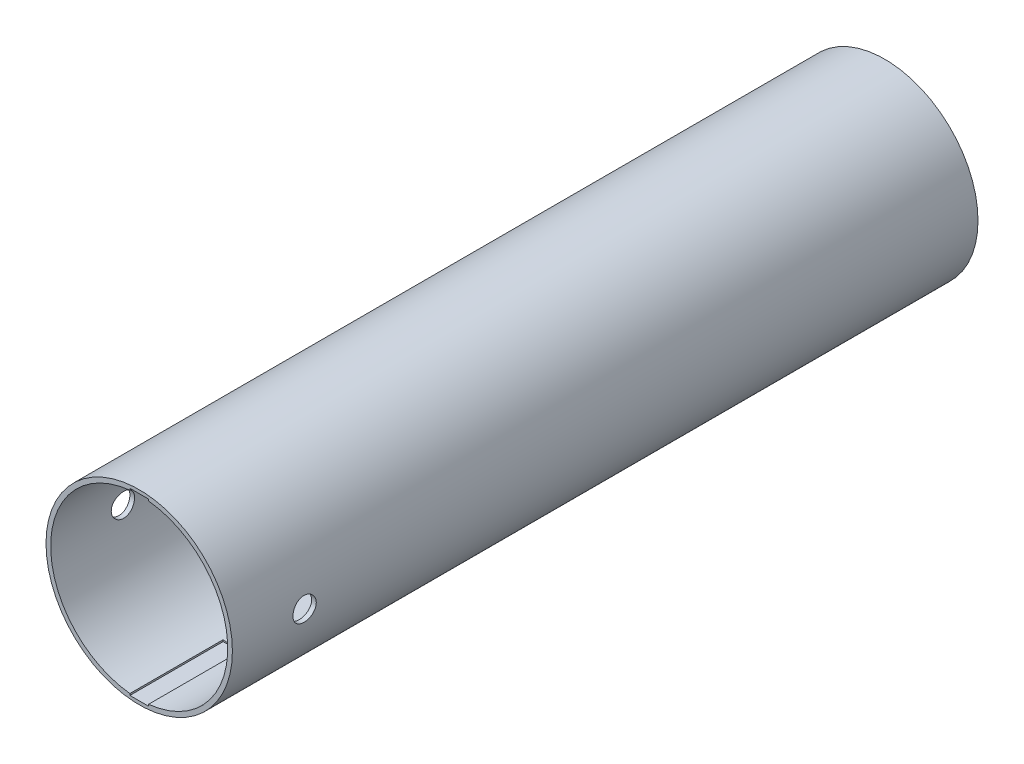
ISO-10303-21;
HEADER;
FILE_DESCRIPTION(('STEP AP214'),'2;1');
FILE_NAME('part.step','',(''),(''),'','','');
FILE_SCHEMA(('AUTOMOTIVE_DESIGN { 1 0 10303 214 1 1 1 1 }'));
ENDSEC;
DATA;
#1=APPLICATION_CONTEXT('core data for automotive mechanical design processes');
#2=APPLICATION_PROTOCOL_DEFINITION('international standard','automotive_design',2000,#1);
#3=PRODUCT_CONTEXT('',#1,'mechanical');
#4=PRODUCT('Part','Part','',(#3));
#5=PRODUCT_RELATED_PRODUCT_CATEGORY('part','',(#4));
#6=PRODUCT_DEFINITION_FORMATION('','',#4);
#7=PRODUCT_DEFINITION_CONTEXT('part definition',#1,'design');
#8=PRODUCT_DEFINITION('design','',#6,#7);
#9=PRODUCT_DEFINITION_SHAPE('','',#8);
#10=(LENGTH_UNIT() NAMED_UNIT(*) SI_UNIT(.MILLI.,.METRE.));
#11=(NAMED_UNIT(*) PLANE_ANGLE_UNIT() SI_UNIT($,.RADIAN.));
#12=(NAMED_UNIT(*) SI_UNIT($,.STERADIAN.) SOLID_ANGLE_UNIT());
#13=UNCERTAINTY_MEASURE_WITH_UNIT(LENGTH_MEASURE(1.E-05),#10,'distance_accuracy_value','');
#14=(GEOMETRIC_REPRESENTATION_CONTEXT(3) GLOBAL_UNCERTAINTY_ASSIGNED_CONTEXT((#13)) GLOBAL_UNIT_ASSIGNED_CONTEXT((#10,
#11,#12)) REPRESENTATION_CONTEXT('',''));
#15=CARTESIAN_POINT('',(0.,0.,0.));
#16=DIRECTION('',(0.,0.,1.));
#17=DIRECTION('',(1.,0.,0.));
#18=AXIS2_PLACEMENT_3D('',#15,#16,#17);
#19=CARTESIAN_POINT('',(0.,0.,80.));
#20=DIRECTION('',(0.,0.,-1.));
#21=DIRECTION('',(-1.,0.,0.));
#22=AXIS2_PLACEMENT_3D('',#19,#20,#21);
#23=CYLINDRICAL_SURFACE('',#22,10.);
#24=CARTESIAN_POINT('',(-10.,0.,71.));
#25=CARTESIAN_POINT('',(-9.99999902448214,0.06992054777788,71.0000029704679));
#26=CARTESIAN_POINT('',(-9.99925892277451,0.139884787151373,71.0058864395847));
#27=CARTESIAN_POINT('',(-9.9963777005568,0.277866401044876,71.0292638772854));
#28=CARTESIAN_POINT('',(-9.99423511720715,0.345881665311872,71.0467699689617));
#29=CARTESIAN_POINT('',(-9.98879030522203,0.477947787406526,71.0928688219571));
#30=CARTESIAN_POINT('',(-9.98548885727771,0.542001280073067,71.1214541209049));
#31=CARTESIAN_POINT('',(-9.97809350439049,0.664389737446516,71.1888836419849));
#32=CARTESIAN_POINT('',(-9.97399973542058,0.722725680778184,71.2277261042654));
#33=CARTESIAN_POINT('',(-9.96545160653163,0.832356408465654,71.3147959749198));
#34=CARTESIAN_POINT('',(-9.96099557346209,0.883615182468556,71.3630685646731));
#35=CARTESIAN_POINT('',(-9.95223863004875,0.97732639677874,71.4675314117683));
#36=CARTESIAN_POINT('',(-9.94793772762134,1.01977838819612,71.5237220724566));
#37=CARTESIAN_POINT('',(-9.93996152809792,1.09480508064197,71.6426599887828));
#38=CARTESIAN_POINT('',(-9.93628838588955,1.12734604797053,71.705428680784));
#39=CARTESIAN_POINT('',(-9.93000564228841,1.18141153828756,71.8355935259737));
#40=CARTESIAN_POINT('',(-9.92739600056568,1.20293647903261,71.9029895035735));
#41=CARTESIAN_POINT('',(-9.92355169801807,1.23424949001238,72.0401220977934));
#42=CARTESIAN_POINT('',(-9.92230991718372,1.24409835736585,72.1098446288521));
#43=CARTESIAN_POINT('',(-9.92132014071396,1.25196777477861,72.2499631317359));
#44=CARTESIAN_POINT('',(-9.92157208500754,1.24998880050121,72.3203590763657));
#45=CARTESIAN_POINT('',(-9.92353477684876,1.23430861822395,72.4594024136244));
#46=CARTESIAN_POINT('',(-9.92523718980164,1.22067438149234,72.5280574931001));
#47=CARTESIAN_POINT('',(-9.92989599878814,1.18217519159102,72.6620975106095));
#48=CARTESIAN_POINT('',(-9.93285242022862,1.15731001087594,72.727482382357));
#49=CARTESIAN_POINT('',(-9.93969557932326,1.09698277995582,72.8533339995109));
#50=CARTESIAN_POINT('',(-9.94358486605722,1.06149162685381,72.9137866501245));
#51=CARTESIAN_POINT('',(-9.95185355715299,0.980940734728451,73.0279033472066));
#52=CARTESIAN_POINT('',(-9.95623298392831,0.935880558040382,73.0815670829869));
#53=CARTESIAN_POINT('',(-9.96502554945212,0.837099555376885,73.1809713553614));
#54=CARTESIAN_POINT('',(-9.96943871193445,0.78332100392,73.226654545883));
#55=CARTESIAN_POINT('',(-9.97777316277926,0.668828584556952,73.3083544400153));
#56=CARTESIAN_POINT('',(-9.98169445000753,0.608114700659113,73.344371121336));
#57=CARTESIAN_POINT('',(-9.9886057610929,0.481430835681728,73.405715660232));
#58=CARTESIAN_POINT('',(-9.99159547200768,0.415459097668848,73.4310399269406));
#59=CARTESIAN_POINT('',(-9.99630392890031,0.28015397021552,73.4702352467616));
#60=CARTESIAN_POINT('',(-9.99802273437935,0.210820738315326,73.4841068360685));
#61=CARTESIAN_POINT('',(-9.9999879820538,0.0712565819567434,73.4999287121303));
#62=CARTESIAN_POINT('',(-10.0002441807132,0.00103474509929933,73.501957996182));
#63=CARTESIAN_POINT('',(-9.99928169002715,-0.13874801824875,73.494246132972));
#64=CARTESIAN_POINT('',(-9.99806303209106,-0.208308958782355,73.4845052363742));
#65=CARTESIAN_POINT('',(-9.99429384378346,-0.344562253860761,73.4535951456128));
#66=CARTESIAN_POINT('',(-9.99174770406934,-0.411263285212351,73.4324636182987));
#67=CARTESIAN_POINT('',(-9.98560861550098,-0.540174827429202,73.3794112740435));
#68=CARTESIAN_POINT('',(-9.98201563110312,-0.602385185732657,73.3474900907543));
#69=CARTESIAN_POINT('',(-9.97415911455056,-0.720902260343714,73.2735734312463));
#70=CARTESIAN_POINT('',(-9.96989222021254,-0.777176879971909,73.2315268550972));
#71=CARTESIAN_POINT('',(-9.96117571162828,-0.881898494813156,73.1386252512329));
#72=CARTESIAN_POINT('',(-9.95672609013449,-0.930345179168424,73.0877698738745));
#73=CARTESIAN_POINT('',(-9.94811552731292,-1.018315979409,72.9783462916214));
#74=CARTESIAN_POINT('',(-9.94395637360664,-1.05778773028396,72.9197358268448));
#75=CARTESIAN_POINT('',(-9.93642705518574,-1.12632644472175,72.7966708775727));
#76=CARTESIAN_POINT('',(-9.93305687465513,-1.15539361686418,72.7322165102618));
#77=CARTESIAN_POINT('',(-9.92749925196497,-1.20221328943327,72.5994623404262));
#78=CARTESIAN_POINT('',(-9.92530872592394,-1.21999531372855,72.531173084976));
#79=CARTESIAN_POINT('',(-9.92234957953727,-1.24383499693392,72.3925487581097));
#80=CARTESIAN_POINT('',(-9.92158089304388,-1.24989320126788,72.3222137820205));
#81=CARTESIAN_POINT('',(-9.92155438491228,-1.25010326804241,72.1820155353977));
#82=CARTESIAN_POINT('',(-9.92228612375977,-1.24433739884963,72.1121523758341));
#83=CARTESIAN_POINT('',(-9.92515557268601,-1.22123720242466,71.9743964353275));
#84=CARTESIAN_POINT('',(-9.92729328291541,-1.20390287395288,71.9065036545956));
#85=CARTESIAN_POINT('',(-9.93273057887275,-1.15818353684483,71.7746265216168));
#86=CARTESIAN_POINT('',(-9.93602974796392,-1.12980249048547,71.7106407774891));
#87=CARTESIAN_POINT('',(-9.94341891622409,-1.06280345107516,71.5883266729759));
#88=CARTESIAN_POINT('',(-9.94750892530207,-1.0241853297548,71.5299983834901));
#89=CARTESIAN_POINT('',(-9.95605302376117,-0.937503165632926,71.4202343873298));
#90=CARTESIAN_POINT('',(-9.96050936042016,-0.889377812887485,71.3688472695225));
#91=CARTESIAN_POINT('',(-9.9692641579645,-0.785175113484194,71.274846587416));
#92=CARTESIAN_POINT('',(-9.97356258137795,-0.729095894570784,71.2322350946128));
#93=CARTESIAN_POINT('',(-9.98153528293373,-0.610332810427102,71.1568573214474));
#94=CARTESIAN_POINT('',(-9.98520712539151,-0.547624639798081,71.1241290970504));
#95=CARTESIAN_POINT('',(-9.99148824538363,-0.417591451150636,71.0697143785419));
#96=CARTESIAN_POINT('',(-9.99409867684788,-0.350271540435114,71.0480158868233));
#97=CARTESIAN_POINT('',(-9.99733360163873,-0.235502885983958,71.0214703309144));
#98=CARTESIAN_POINT('',(-9.99832862947727,-0.188777831758456,71.013430529009));
#99=CARTESIAN_POINT('',(-9.99966215664594,-0.0947085316062152,71.0026943771534));
#100=CARTESIAN_POINT('',(-10.0000006608173,-0.0473642902480127,70.9999979878004));
#101=CARTESIAN_POINT('',(-10.,0.,71.));
#102=B_SPLINE_CURVE_WITH_KNOTS('',3,(#24,#25,#26,#27,#28,#29,#30,#31,#32,#33,#34,#35,#36,#37,
#38,#39,#40,#41,#42,#43,#44,#45,#46,#47,#48,#49,#50,#51,#52,#53,#54,#55,#56,#57,#58,#59,#60,#61,
#62,#63,#64,#65,#66,#67,#68,#69,#70,#71,#72,#73,#74,#75,#76,#77,#78,#79,#80,#81,#82,#83,#84,#85,
#86,#87,#88,#89,#90,#91,#92,#93,#94,#95,#96,#97,#98,#99,#100,#101),.UNSPECIFIED.,.T.,.F.,(4,2,2,
2,2,2,2,2,2,2,2,2,2,2,2,2,2,2,2,2,2,2,2,2,2,2,2,2,2,2,2,2,2,2,2,2,2,2,4),(0.,0.209588636388123,
0.419396230471714,0.629062754090883,0.838693327955367,1.04935406600919,1.26002553900005,
1.47140625159435,1.68277894748403,1.89304612643161,2.10330484942333,2.31236348220847,
2.52142635083122,2.73106713142767,2.94071750256819,3.15181739068209,3.36291776556558,
3.57408897865803,3.7852503045189,3.9950013969596,4.20474802250964,4.41380526946697,
4.62286961539473,4.83301201464211,5.04316275687543,5.25450985753785,5.46585272110768,
5.67664037140462,5.88741821505313,6.09673450601106,6.30605081939772,6.51529212353242,
6.72453604956129,6.93517618845913,7.14586599235006,7.35735701518426,7.56861749342016,
7.71059421593813,7.85256989150217),.UNSPECIFIED.);
#103=CARTESIAN_POINT('',(-10.,0.,71.));
#104=VERTEX_POINT('',#103);
#105=EDGE_CURVE('E182',#104,#104,#102,.T.);
#106=ORIENTED_EDGE('',*,*,#105,.T.);
#107=EDGE_LOOP('',(#106));
#108=FACE_BOUND('',#107,.T.);
#109=CARTESIAN_POINT('',(10.,0.,71.));
#110=CARTESIAN_POINT('',(9.99999902448214,-0.06992054777788,71.0000029704679));
#111=CARTESIAN_POINT('',(9.99925892277451,-0.139884787151373,71.0058864395847));
#112=CARTESIAN_POINT('',(9.9963777005568,-0.277866401044876,71.0292638772854));
#113=CARTESIAN_POINT('',(9.99423511720715,-0.345881665311872,71.0467699689617));
#114=CARTESIAN_POINT('',(9.98879030522203,-0.477947787406526,71.0928688219571));
#115=CARTESIAN_POINT('',(9.98548885727771,-0.542001280073067,71.1214541209049));
#116=CARTESIAN_POINT('',(9.97809350439049,-0.664389737446516,71.1888836419849));
#117=CARTESIAN_POINT('',(9.97399973542058,-0.722725680778184,71.2277261042654));
#118=CARTESIAN_POINT('',(9.96545160653163,-0.832356408465654,71.3147959749198));
#119=CARTESIAN_POINT('',(9.96099557346209,-0.883615182468556,71.3630685646731));
#120=CARTESIAN_POINT('',(9.95223863004875,-0.97732639677874,71.4675314117683));
#121=CARTESIAN_POINT('',(9.94793772762134,-1.01977838819612,71.5237220724566));
#122=CARTESIAN_POINT('',(9.93996152809792,-1.09480508064197,71.6426599887828));
#123=CARTESIAN_POINT('',(9.93628838588955,-1.12734604797053,71.705428680784));
#124=CARTESIAN_POINT('',(9.93000564228841,-1.18141153828756,71.8355935259737));
#125=CARTESIAN_POINT('',(9.92739600056568,-1.20293647903261,71.9029895035735));
#126=CARTESIAN_POINT('',(9.92355169801807,-1.23424949001238,72.0401220977934));
#127=CARTESIAN_POINT('',(9.92230991718372,-1.24409835736585,72.1098446288521));
#128=CARTESIAN_POINT('',(9.92132014071396,-1.25196777477861,72.2499631317359));
#129=CARTESIAN_POINT('',(9.92157208500754,-1.24998880050121,72.3203590763657));
#130=CARTESIAN_POINT('',(9.92353477684876,-1.23430861822395,72.4594024136244));
#131=CARTESIAN_POINT('',(9.92523718980164,-1.22067438149234,72.5280574931001));
#132=CARTESIAN_POINT('',(9.92989599878814,-1.18217519159102,72.6620975106095));
#133=CARTESIAN_POINT('',(9.93285242022862,-1.15731001087594,72.727482382357));
#134=CARTESIAN_POINT('',(9.93969557932326,-1.09698277995582,72.8533339995109));
#135=CARTESIAN_POINT('',(9.94358486605722,-1.06149162685381,72.9137866501245));
#136=CARTESIAN_POINT('',(9.95185355715299,-0.980940734728451,73.0279033472066));
#137=CARTESIAN_POINT('',(9.95623298392831,-0.935880558040382,73.0815670829869));
#138=CARTESIAN_POINT('',(9.96502554945212,-0.837099555376885,73.1809713553614));
#139=CARTESIAN_POINT('',(9.96943871193445,-0.78332100392,73.226654545883));
#140=CARTESIAN_POINT('',(9.97777316277926,-0.668828584556952,73.3083544400153));
#141=CARTESIAN_POINT('',(9.98169445000753,-0.608114700659113,73.344371121336));
#142=CARTESIAN_POINT('',(9.9886057610929,-0.481430835681728,73.405715660232));
#143=CARTESIAN_POINT('',(9.99159547200768,-0.415459097668848,73.4310399269406));
#144=CARTESIAN_POINT('',(9.99630392890031,-0.28015397021552,73.4702352467616));
#145=CARTESIAN_POINT('',(9.99802273437935,-0.210820738315326,73.4841068360685));
#146=CARTESIAN_POINT('',(9.9999879820538,-0.0712565819567434,73.4999287121303));
#147=CARTESIAN_POINT('',(10.0002441807132,-0.00103474509929933,73.501957996182));
#148=CARTESIAN_POINT('',(9.99928169002715,0.13874801824875,73.494246132972));
#149=CARTESIAN_POINT('',(9.99806303209106,0.208308958782355,73.4845052363742));
#150=CARTESIAN_POINT('',(9.99429384378346,0.344562253860761,73.4535951456128));
#151=CARTESIAN_POINT('',(9.99174770406934,0.411263285212351,73.4324636182987));
#152=CARTESIAN_POINT('',(9.98560861550098,0.540174827429202,73.3794112740435));
#153=CARTESIAN_POINT('',(9.98201563110312,0.602385185732657,73.3474900907543));
#154=CARTESIAN_POINT('',(9.97415911455056,0.720902260343714,73.2735734312463));
#155=CARTESIAN_POINT('',(9.96989222021254,0.777176879971909,73.2315268550972));
#156=CARTESIAN_POINT('',(9.96117571162828,0.881898494813156,73.1386252512329));
#157=CARTESIAN_POINT('',(9.95672609013449,0.930345179168424,73.0877698738745));
#158=CARTESIAN_POINT('',(9.94811552731292,1.018315979409,72.9783462916214));
#159=CARTESIAN_POINT('',(9.94395637360664,1.05778773028396,72.9197358268448));
#160=CARTESIAN_POINT('',(9.93642705518574,1.12632644472175,72.7966708775727));
#161=CARTESIAN_POINT('',(9.93305687465513,1.15539361686418,72.7322165102618));
#162=CARTESIAN_POINT('',(9.92749925196497,1.20221328943327,72.5994623404262));
#163=CARTESIAN_POINT('',(9.92530872592394,1.21999531372855,72.531173084976));
#164=CARTESIAN_POINT('',(9.92234957953727,1.24383499693392,72.3925487581097));
#165=CARTESIAN_POINT('',(9.92158089304388,1.24989320126788,72.3222137820205));
#166=CARTESIAN_POINT('',(9.92155438491228,1.25010326804241,72.1820155353977));
#167=CARTESIAN_POINT('',(9.92228612375977,1.24433739884963,72.1121523758341));
#168=CARTESIAN_POINT('',(9.92515557268601,1.22123720242466,71.9743964353275));
#169=CARTESIAN_POINT('',(9.92729328291541,1.20390287395288,71.9065036545956));
#170=CARTESIAN_POINT('',(9.93273057887275,1.15818353684483,71.7746265216168));
#171=CARTESIAN_POINT('',(9.93602974796392,1.12980249048547,71.7106407774891));
#172=CARTESIAN_POINT('',(9.94341891622409,1.06280345107516,71.5883266729759));
#173=CARTESIAN_POINT('',(9.94750892530207,1.0241853297548,71.5299983834901));
#174=CARTESIAN_POINT('',(9.95605302376117,0.937503165632926,71.4202343873298));
#175=CARTESIAN_POINT('',(9.96050936042016,0.889377812887485,71.3688472695225));
#176=CARTESIAN_POINT('',(9.9692641579645,0.785175113484194,71.274846587416));
#177=CARTESIAN_POINT('',(9.97356258137795,0.729095894570784,71.2322350946128));
#178=CARTESIAN_POINT('',(9.98153528293373,0.610332810427102,71.1568573214474));
#179=CARTESIAN_POINT('',(9.98520712539151,0.547624639798081,71.1241290970504));
#180=CARTESIAN_POINT('',(9.99148824538363,0.417591451150636,71.0697143785419));
#181=CARTESIAN_POINT('',(9.99409867684788,0.350271540435114,71.0480158868233));
#182=CARTESIAN_POINT('',(9.99733360163873,0.235502885983958,71.0214703309144));
#183=CARTESIAN_POINT('',(9.99832862947727,0.188777831758456,71.013430529009));
#184=CARTESIAN_POINT('',(9.99966215664594,0.0947085316062152,71.0026943771534));
#185=CARTESIAN_POINT('',(10.0000006608173,0.0473642902480127,70.9999979878004));
#186=CARTESIAN_POINT('',(10.,0.,71.));
#187=B_SPLINE_CURVE_WITH_KNOTS('',3,(#109,#110,#111,#112,#113,#114,#115,#116,#117,#118,#119,
#120,#121,#122,#123,#124,#125,#126,#127,#128,#129,#130,#131,#132,#133,#134,#135,#136,#137,#138,
#139,#140,#141,#142,#143,#144,#145,#146,#147,#148,#149,#150,#151,#152,#153,#154,#155,#156,#157,
#158,#159,#160,#161,#162,#163,#164,#165,#166,#167,#168,#169,#170,#171,#172,#173,#174,#175,#176,
#177,#178,#179,#180,#181,#182,#183,#184,#185,#186),.UNSPECIFIED.,.T.,.F.,(4,2,2,2,2,2,2,2,2,2,2,
2,2,2,2,2,2,2,2,2,2,2,2,2,2,2,2,2,2,2,2,2,2,2,2,2,2,2,4),(0.,0.209588636388123,
0.419396230471714,0.629062754090883,0.838693327955367,1.04935406600919,1.26002553900005,
1.47140625159435,1.68277894748403,1.89304612643161,2.10330484942333,2.31236348220847,
2.52142635083122,2.73106713142767,2.94071750256819,3.15181739068209,3.36291776556558,
3.57408897865803,3.7852503045189,3.9950013969596,4.20474802250964,4.41380526946697,
4.62286961539473,4.83301201464211,5.04316275687543,5.25450985753785,5.46585272110768,
5.67664037140462,5.88741821505313,6.09673450601106,6.30605081939772,6.51529212353242,
6.72453604956129,6.93517618845913,7.14586599235006,7.35735701518426,7.56861749342016,
7.71059421593813,7.85256989150217),.UNSPECIFIED.);
#188=CARTESIAN_POINT('',(10.,0.,71.));
#189=VERTEX_POINT('',#188);
#190=EDGE_CURVE('E174',#189,#189,#187,.T.);
#191=ORIENTED_EDGE('',*,*,#190,.T.);
#192=EDGE_LOOP('',(#191));
#193=FACE_BOUND('',#192,.T.);
#194=CARTESIAN_POINT('',(0.,0.,80.));
#195=DIRECTION('',(0.,0.,1.));
#196=DIRECTION('',(1.,0.,0.));
#197=AXIS2_PLACEMENT_3D('',#194,#195,#196);
#198=CIRCLE('',#197,10.);
#199=CARTESIAN_POINT('',(10.,0.,80.));
#200=VERTEX_POINT('',#199);
#201=EDGE_CURVE('E219',#200,#200,#198,.T.);
#202=ORIENTED_EDGE('',*,*,#201,.F.);
#203=EDGE_LOOP('',(#202));
#204=FACE_BOUND('',#203,.T.);
#205=CARTESIAN_POINT('',(0.,0.,0.));
#206=DIRECTION('',(0.,0.,1.));
#207=DIRECTION('',(1.,0.,0.));
#208=AXIS2_PLACEMENT_3D('',#205,#206,#207);
#209=CIRCLE('',#208,10.);
#210=CARTESIAN_POINT('',(10.,0.,0.));
#211=VERTEX_POINT('',#210);
#212=EDGE_CURVE('E248',#211,#211,#209,.T.);
#213=ORIENTED_EDGE('',*,*,#212,.T.);
#214=EDGE_LOOP('',(#213));
#215=FACE_BOUND('',#214,.T.);
#216=ADVANCED_FACE('F45',(#108,#193,#204,#215),#23,.T.);
#217=CARTESIAN_POINT('',(0.,0.,80.));
#218=DIRECTION('',(0.,0.,1.));
#219=DIRECTION('',(1.,0.,0.));
#220=AXIS2_PLACEMENT_3D('',#217,#218,#219);
#221=PLANE('',#220);
#222=DIRECTION('',(0.,1.,0.));
#223=VECTOR('',#222,1.);
#224=CARTESIAN_POINT('',(1.00000000000001,9.625,80.));
#225=LINE('',#224,#223);
#226=CARTESIAN_POINT('',(1.00000000000001,9.44722181384559,80.));
#227=VERTEX_POINT('',#226);
#228=CARTESIAN_POINT('',(1.00000000000001,9.625,80.));
#229=VERTEX_POINT('',#228);
#230=EDGE_CURVE('E126',#227,#229,#225,.T.);
#231=ORIENTED_EDGE('',*,*,#230,.F.);
#232=CARTESIAN_POINT('',(0.,0.,80.));
#233=DIRECTION('',(0.,0.,1.));
#234=DIRECTION('',(1.,0.,0.));
#235=AXIS2_PLACEMENT_3D('',#232,#233,#234);
#236=CIRCLE('',#235,9.5);
#237=CARTESIAN_POINT('',(1.00000000000001,-9.44722181384559,80.));
#238=VERTEX_POINT('',#237);
#239=EDGE_CURVE('E238',#238,#227,#236,.T.);
#240=ORIENTED_EDGE('',*,*,#239,.F.);
#241=DIRECTION('',(0.,1.,0.));
#242=VECTOR('',#241,1.);
#243=CARTESIAN_POINT('',(1.00000000000001,-9.625,80.));
#244=LINE('',#243,#242);
#245=CARTESIAN_POINT('',(1.00000000000001,-9.625,80.));
#246=VERTEX_POINT('',#245);
#247=EDGE_CURVE('E154',#246,#238,#244,.T.);
#248=ORIENTED_EDGE('',*,*,#247,.F.);
#249=DIRECTION('',(1.,0.,0.));
#250=VECTOR('',#249,1.);
#251=CARTESIAN_POINT('',(-0.999999999999993,-9.625,80.));
#252=LINE('',#251,#250);
#253=CARTESIAN_POINT('',(-0.999999999999993,-9.625,80.));
#254=VERTEX_POINT('',#253);
#255=EDGE_CURVE('E163',#254,#246,#252,.T.);
#256=ORIENTED_EDGE('',*,*,#255,.F.);
#257=DIRECTION('',(0.,-1.,0.));
#258=VECTOR('',#257,1.);
#259=CARTESIAN_POINT('',(-0.999999999999993,-9.625,80.));
#260=LINE('',#259,#258);
#261=CARTESIAN_POINT('',(-0.999999999999993,-9.44722181384559,80.));
#262=VERTEX_POINT('',#261);
#263=EDGE_CURVE('E160',#262,#254,#260,.T.);
#264=ORIENTED_EDGE('',*,*,#263,.F.);
#265=CARTESIAN_POINT('',(-0.999999999999993,9.44722181384559,80.));
#266=VERTEX_POINT('',#265);
#267=EDGE_CURVE('E244',#266,#262,#236,.T.);
#268=ORIENTED_EDGE('',*,*,#267,.F.);
#269=DIRECTION('',(0.,-1.,0.));
#270=VECTOR('',#269,1.);
#271=CARTESIAN_POINT('',(-0.999999999999993,9.625,80.));
#272=LINE('',#271,#270);
#273=CARTESIAN_POINT('',(-0.999999999999993,9.625,80.));
#274=VERTEX_POINT('',#273);
#275=EDGE_CURVE('E120',#274,#266,#272,.T.);
#276=ORIENTED_EDGE('',*,*,#275,.F.);
#277=DIRECTION('',(-1.,0.,0.));
#278=VECTOR('',#277,1.);
#279=CARTESIAN_POINT('',(-0.999999999999993,9.625,80.));
#280=LINE('',#279,#278);
#281=EDGE_CURVE('E141',#229,#274,#280,.T.);
#282=ORIENTED_EDGE('',*,*,#281,.F.);
#283=EDGE_LOOP('',(#231,#240,#248,#256,#264,#268,#276,#282));
#284=FACE_BOUND('',#283,.T.);
#285=ORIENTED_EDGE('',*,*,#201,.T.);
#286=EDGE_LOOP('',(#285));
#287=FACE_BOUND('',#286,.T.);
#288=ADVANCED_FACE('F240',(#284,#287),#221,.T.);
#289=CARTESIAN_POINT('',(0.,0.,0.));
#290=DIRECTION('',(0.,0.,1.));
#291=DIRECTION('',(1.,0.,0.));
#292=AXIS2_PLACEMENT_3D('',#289,#290,#291);
#293=PLANE('',#292);
#294=ORIENTED_EDGE('',*,*,#212,.F.);
#295=EDGE_LOOP('',(#294));
#296=FACE_BOUND('',#295,.T.);
#297=ADVANCED_FACE('F264',(#296),#293,.F.);
#298=CARTESIAN_POINT('',(0.,0.,80.));
#299=DIRECTION('',(0.,0.,-1.));
#300=DIRECTION('',(-1.,0.,0.));
#301=AXIS2_PLACEMENT_3D('',#298,#299,#300);
#302=CYLINDRICAL_SURFACE('',#301,9.5);
#303=DIRECTION('',(0.,0.,-1.));
#304=VECTOR('',#303,1.);
#305=CARTESIAN_POINT('',(1.00000000000001,9.44722181384559,80.));
#306=LINE('',#305,#304);
#307=CARTESIAN_POINT('',(1.00000000000001,9.44722181384559,70.));
#308=VERTEX_POINT('',#307);
#309=EDGE_CURVE('E11',#308,#227,#306,.F.);
#310=ORIENTED_EDGE('',*,*,#309,.F.);
#311=CARTESIAN_POINT('',(0.,0.,70.));
#312=DIRECTION('',(0.,0.,1.));
#313=DIRECTION('',(1.,0.,0.));
#314=AXIS2_PLACEMENT_3D('',#311,#312,#313);
#315=CIRCLE('',#314,9.5);
#316=CARTESIAN_POINT('',(-0.999999999999993,9.44722181384559,70.));
#317=VERTEX_POINT('',#316);
#318=EDGE_CURVE('E116',#308,#317,#315,.T.);
#319=ORIENTED_EDGE('',*,*,#318,.T.);
#320=DIRECTION('',(0.,0.,-1.));
#321=VECTOR('',#320,1.);
#322=CARTESIAN_POINT('',(-0.999999999999993,9.44722181384559,80.));
#323=LINE('',#322,#321);
#324=EDGE_CURVE('E54',#266,#317,#323,.T.);
#325=ORIENTED_EDGE('',*,*,#324,.F.);
#326=ORIENTED_EDGE('',*,*,#267,.T.);
#327=DIRECTION('',(0.,0.,-1.));
#328=VECTOR('',#327,1.);
#329=CARTESIAN_POINT('',(-0.999999999999993,-9.44722181384559,80.));
#330=LINE('',#329,#328);
#331=CARTESIAN_POINT('',(-0.999999999999993,-9.44722181384559,70.));
#332=VERTEX_POINT('',#331);
#333=EDGE_CURVE('E222',#332,#262,#330,.F.);
#334=ORIENTED_EDGE('',*,*,#333,.F.);
#335=CARTESIAN_POINT('',(0.,0.,70.));
#336=DIRECTION('',(0.,0.,-1.));
#337=DIRECTION('',(-1.,0.,0.));
#338=AXIS2_PLACEMENT_3D('',#335,#336,#337);
#339=CIRCLE('',#338,9.5);
#340=CARTESIAN_POINT('',(1.00000000000001,-9.44722181384559,70.));
#341=VERTEX_POINT('',#340);
#342=EDGE_CURVE('E215',#341,#332,#339,.T.);
#343=ORIENTED_EDGE('',*,*,#342,.F.);
#344=DIRECTION('',(0.,0.,-1.));
#345=VECTOR('',#344,1.);
#346=CARTESIAN_POINT('',(1.00000000000001,-9.44722181384559,80.));
#347=LINE('',#346,#345);
#348=EDGE_CURVE('E218',#238,#341,#347,.T.);
#349=ORIENTED_EDGE('',*,*,#348,.F.);
#350=ORIENTED_EDGE('',*,*,#239,.T.);
#351=EDGE_LOOP('',(#310,#319,#325,#326,#334,#343,#349,#350));
#352=FACE_BOUND('',#351,.T.);
#353=CARTESIAN_POINT('',(-9.5,0.,73.5));
#354=CARTESIAN_POINT('',(-9.49999898388699,-0.0698891577446902,73.4999970504731));
#355=CARTESIAN_POINT('',(-9.49922063417787,-0.139821223747716,73.4941188373793));
#356=CARTESIAN_POINT('',(-9.49619052111643,-0.277737237008381,73.4707635020182));
#357=CARTESIAN_POINT('',(-9.49393724481659,-0.345719108974801,73.4532744693628));
#358=CARTESIAN_POINT('',(-9.48821096867027,-0.477718321462634,73.4072235295305));
#359=CARTESIAN_POINT('',(-9.4847388149622,-0.541738376084686,73.3786693023297));
#360=CARTESIAN_POINT('',(-9.47696034061076,-0.664066389164282,73.3113158272721));
#361=CARTESIAN_POINT('',(-9.47265415634291,-0.722375279132391,73.2725182539679));
#362=CARTESIAN_POINT('',(-9.46365868232214,-0.831991543439547,73.1855276905619));
#363=CARTESIAN_POINT('',(-9.45896744086581,-0.883259216449905,73.1372848697635));
#364=CARTESIAN_POINT('',(-9.44974620597995,-0.976995665734432,73.0328803236651));
#365=CARTESIAN_POINT('',(-9.44521622102649,-1.01946398005465,72.9767181828718));
#366=CARTESIAN_POINT('',(-9.43681128294316,-1.09454581169274,72.8578089492471));
#367=CARTESIAN_POINT('',(-9.43293884705226,-1.12712181814551,72.7950379779733));
#368=CARTESIAN_POINT('',(-9.42631346347733,-1.18125473128304,72.6648566548344));
#369=CARTESIAN_POINT('',(-9.42356046883313,-1.20281210020545,72.5974464977203));
#370=CARTESIAN_POINT('',(-9.41950447444247,-1.23417446556436,72.4603138855888));
#371=CARTESIAN_POINT('',(-9.41819317554674,-1.24404675286152,72.3906070698533));
#372=CARTESIAN_POINT('',(-9.41714370405327,-1.25196699771812,72.2505147107269));
#373=CARTESIAN_POINT('',(-9.41740546157894,-1.25001548050153,72.180129197623));
#374=CARTESIAN_POINT('',(-9.41946493300181,-1.23439868875378,72.0411479510278));
#375=CARTESIAN_POINT('',(-9.4212529010043,-1.22080773813353,71.9725437010316));
#376=CARTESIAN_POINT('',(-9.42614812938148,-1.18241393441074,71.8385981186233));
#377=CARTESIAN_POINT('',(-9.42925541911596,-1.15761083179558,71.7732568588609));
#378=CARTESIAN_POINT('',(-9.43645015999781,-1.09741754548877,71.647462332422));
#379=CARTESIAN_POINT('',(-9.44054057510145,-1.06199526534778,71.5870246004947));
#380=CARTESIAN_POINT('',(-9.44923842883531,-0.981592067178583,71.4729230343496));
#381=CARTESIAN_POINT('',(-9.45384589364672,-0.936610665013906,71.4192595434432));
#382=CARTESIAN_POINT('',(-9.46310196431143,-0.837955139278333,71.3197985245393));
#383=CARTESIAN_POINT('',(-9.46775061467423,-0.784216991395045,71.2740644825594));
#384=CARTESIAN_POINT('',(-9.47653227200754,-0.669793294455653,71.1922555798297));
#385=CARTESIAN_POINT('',(-9.48066527755955,-0.609107726288857,71.156180745651));
#386=CARTESIAN_POINT('',(-9.48795293479305,-0.482461378646908,71.0947134565616));
#387=CARTESIAN_POINT('',(-9.49110720151756,-0.416498536315519,71.0693252034944));
#388=CARTESIAN_POINT('',(-9.49607856940107,-0.281195165615944,71.0300033282812));
#389=CARTESIAN_POINT('',(-9.49789573996917,-0.211854812774675,71.0160691115481));
#390=CARTESIAN_POINT('',(-9.49997910680566,-0.072313420797526,71.0001336576662));
#391=CARTESIAN_POINT('',(-9.50025666394529,-0.00212252698950078,70.9980450090038));
#392=CARTESIAN_POINT('',(-9.49926026666329,0.137608332633309,71.0056289713269));
#393=CARTESIAN_POINT('',(-9.49798634894085,0.207148313805823,71.0153013041134));
#394=CARTESIAN_POINT('',(-9.4940372010179,0.343343754574996,71.0460600295161));
#395=CARTESIAN_POINT('',(-9.4913671163958,0.410008839502242,71.0671045194689));
#396=CARTESIAN_POINT('',(-9.48492442408429,0.53886384530802,71.1199664656117));
#397=CARTESIAN_POINT('',(-9.48115177531735,0.60105359934446,71.1517843231851));
#398=CARTESIAN_POINT('',(-9.47289589414175,0.719581517776556,71.2254997174083));
#399=CARTESIAN_POINT('',(-9.46840874397782,0.77588440579981,71.2674535289432));
#400=CARTESIAN_POINT('',(-9.45923747369867,0.880680914767174,71.3601706170332));
#401=CARTESIAN_POINT('',(-9.45455334489189,0.929174190660307,71.410934282627));
#402=CARTESIAN_POINT('',(-9.4454807524801,1.01728702566562,71.5202161629121));
#403=CARTESIAN_POINT('',(-9.44109434790601,1.05684847689664,71.5787814254935));
#404=CARTESIAN_POINT('',(-9.43314836944188,1.12557262175274,71.701776838225));
#405=CARTESIAN_POINT('',(-9.42958877749035,1.15473554253827,71.7662068602184));
#406=CARTESIAN_POINT('',(-9.42371371765608,1.20174170294374,71.8989188776009));
#407=CARTESIAN_POINT('',(-9.42139471115488,1.21961716525156,71.9671892964293));
#408=CARTESIAN_POINT('',(-9.41825342941145,1.24364448346356,72.105795422781));
#409=CARTESIAN_POINT('',(-9.41743107637251,1.24979694873514,72.1761310227621));
#410=CARTESIAN_POINT('',(-9.4173786418146,1.25019162856568,72.3162926089517));
#411=CARTESIAN_POINT('',(-9.41813635402617,1.24452514640517,72.3861183509715));
#412=CARTESIAN_POINT('',(-9.42113236258287,1.22163669578697,72.5238155072501));
#413=CARTESIAN_POINT('',(-9.4233706585334,1.20441473040899,72.5916869220298));
#414=CARTESIAN_POINT('',(-9.42907173824993,1.15893367377168,72.7235334905478));
#415=CARTESIAN_POINT('',(-9.43253397914272,1.1306794752113,72.7875103569659));
#416=CARTESIAN_POINT('',(-9.44029367351982,1.06394495730012,72.9098298621194));
#417=CARTESIAN_POINT('',(-9.44459114191469,1.02546445538391,72.9681724002425));
#418=CARTESIAN_POINT('',(-9.45357680022683,0.939032542620354,73.0780332172149));
#419=CARTESIAN_POINT('',(-9.45826764573149,0.891013165736411,73.1294978116378));
#420=CARTESIAN_POINT('',(-9.46748837677969,0.787009174319991,73.2236727218723));
#421=CARTESIAN_POINT('',(-9.47201822426547,0.731022691916981,73.2663809790324));
#422=CARTESIAN_POINT('',(-9.48042783846154,0.612401395289745,73.3419861195341));
#423=CARTESIAN_POINT('',(-9.4843047899312,0.549739600834483,73.3748409679122));
#424=CARTESIAN_POINT('',(-9.49094356757333,0.419770486521839,73.4295136505256));
#425=CARTESIAN_POINT('',(-9.4937065909269,0.352468245550858,73.4513433403341));
#426=CARTESIAN_POINT('',(-9.4971487575473,0.237357221483916,73.4781872631123));
#427=CARTESIAN_POINT('',(-9.4982126958584,0.190270842343242,73.4863551034862));
#428=CARTESIAN_POINT('',(-9.4996386611571,0.0954629792925189,73.497262456279));
#429=CARTESIAN_POINT('',(-9.50000069410996,0.0477415007834303,73.500002014831));
#430=CARTESIAN_POINT('',(-9.5,0.,73.5));
#431=B_SPLINE_CURVE_WITH_KNOTS('',3,(#353,#354,#355,#356,#357,#358,#359,#360,#361,#362,#363,
#364,#365,#366,#367,#368,#369,#370,#371,#372,#373,#374,#375,#376,#377,#378,#379,#380,#381,#382,
#383,#384,#385,#386,#387,#388,#389,#390,#391,#392,#393,#394,#395,#396,#397,#398,#399,#400,#401,
#402,#403,#404,#405,#406,#407,#408,#409,#410,#411,#412,#413,#414,#415,#416,#417,#418,#419,#420,
#421,#422,#423,#424,#425,#426,#427,#428,#429,#430),.UNSPECIFIED.,.T.,.F.,(4,2,2,2,2,2,2,2,2,2,2,
2,2,2,2,2,2,2,2,2,2,2,2,2,2,2,2,2,2,2,2,2,2,2,2,2,2,2,4),(0.,0.209493072375357,
0.419201375647517,0.62876438744586,0.838293161679495,1.04895868548498,1.25963526613331,
1.47110101760718,1.68255789725312,1.89279104241026,2.10301484889149,2.31190619019214,
2.52080218034093,2.73033603555644,2.93988050546708,3.15103211195917,3.36218429929278,
3.57341943191216,3.78464359847391,3.99430703870754,4.20396551957759,4.41285669353144,
4.62175565100022,4.83184220415875,5.04193803699636,5.25336364761434,5.46478463926427,
5.67559931873911,5.88640303965956,6.09558430110585,6.30476550680214,6.51385404763949,
6.72294632148712,6.9335856080951,7.14427436023557,7.35584953436961,7.56719671049369,
7.71030329529441,7.8534086638763),.UNSPECIFIED.);
#432=CARTESIAN_POINT('',(-9.5,0.,73.5));
#433=VERTEX_POINT('',#432);
#434=EDGE_CURVE('E183',#433,#433,#431,.T.);
#435=ORIENTED_EDGE('',*,*,#434,.F.);
#436=EDGE_LOOP('',(#435));
#437=FACE_BOUND('',#436,.T.);
#438=CARTESIAN_POINT('',(9.5,0.,71.));
#439=CARTESIAN_POINT('',(9.49999898388699,-0.069889157744691,71.000002949527));
#440=CARTESIAN_POINT('',(9.49922063417787,-0.139821223747717,71.0058811626208));
#441=CARTESIAN_POINT('',(9.49619052111643,-0.277737237008383,71.0292364979818));
#442=CARTESIAN_POINT('',(9.49393724481659,-0.345719108974803,71.0467255306372));
#443=CARTESIAN_POINT('',(9.48821096867027,-0.477718321462628,71.0927764704695));
#444=CARTESIAN_POINT('',(9.48473881496221,-0.541738376084673,71.1213306976703));
#445=CARTESIAN_POINT('',(9.47696034061076,-0.664066389164269,71.1886841727279));
#446=CARTESIAN_POINT('',(9.47265415634291,-0.722375279132386,71.2274817460321));
#447=CARTESIAN_POINT('',(9.46365868232214,-0.831991543439548,71.3144723094381));
#448=CARTESIAN_POINT('',(9.45896744086581,-0.883259216449905,71.3627151302365));
#449=CARTESIAN_POINT('',(9.44974620597995,-0.976995665734432,71.467119676335));
#450=CARTESIAN_POINT('',(9.44521622102649,-1.01946398005466,71.5232818171282));
#451=CARTESIAN_POINT('',(9.43681128294316,-1.09454581169274,71.6421910507529));
#452=CARTESIAN_POINT('',(9.43293884705227,-1.1271218181455,71.7049620220267));
#453=CARTESIAN_POINT('',(9.42631346347733,-1.18125473128303,71.8351433451656));
#454=CARTESIAN_POINT('',(9.42356046883313,-1.20281210020545,71.9025535022797));
#455=CARTESIAN_POINT('',(9.41950447444247,-1.23417446556436,72.0396861144112));
#456=CARTESIAN_POINT('',(9.41819317554674,-1.24404675286152,72.1093929301468));
#457=CARTESIAN_POINT('',(9.41714370405327,-1.25196699771812,72.2494852892731));
#458=CARTESIAN_POINT('',(9.41740546157894,-1.25001548050153,72.319870802377));
#459=CARTESIAN_POINT('',(9.41946493300181,-1.23439868875378,72.4588520489723));
#460=CARTESIAN_POINT('',(9.4212529010043,-1.22080773813353,72.5274562989684));
#461=CARTESIAN_POINT('',(9.42614812938148,-1.18241393441074,72.6614018813767));
#462=CARTESIAN_POINT('',(9.42925541911596,-1.15761083179558,72.7267431411392));
#463=CARTESIAN_POINT('',(9.43645015999781,-1.09741754548877,72.852537667578));
#464=CARTESIAN_POINT('',(9.44054057510145,-1.06199526534778,72.9129753995053));
#465=CARTESIAN_POINT('',(9.44923842883531,-0.981592067178583,73.0270769656504));
#466=CARTESIAN_POINT('',(9.45384589364672,-0.936610665013906,73.0807404565568));
#467=CARTESIAN_POINT('',(9.46310196431143,-0.837955139278333,73.1802014754607));
#468=CARTESIAN_POINT('',(9.46775061467423,-0.784216991395045,73.2259355174406));
#469=CARTESIAN_POINT('',(9.47653227200754,-0.669793294455653,73.3077444201703));
#470=CARTESIAN_POINT('',(9.48066527755955,-0.609107726288857,73.343819254349));
#471=CARTESIAN_POINT('',(9.48795293479305,-0.482461378646908,73.4052865434384));
#472=CARTESIAN_POINT('',(9.49110720151756,-0.416498536315519,73.4306747965056));
#473=CARTESIAN_POINT('',(9.49607856940107,-0.281195165615944,73.4699966717188));
#474=CARTESIAN_POINT('',(9.49789573996917,-0.211854812774675,73.4839308884519));
#475=CARTESIAN_POINT('',(9.49997910680566,-0.0723134207975259,73.4998663423339));
#476=CARTESIAN_POINT('',(9.50025666394529,-0.0021225269895005,73.5019549909962));
#477=CARTESIAN_POINT('',(9.49926026666329,0.137608332633308,73.4943710286731));
#478=CARTESIAN_POINT('',(9.49798634894085,0.207148313805822,73.4846986958866));
#479=CARTESIAN_POINT('',(9.4940372010179,0.343343754574994,73.4539399704839));
#480=CARTESIAN_POINT('',(9.4913671163958,0.41000883950224,73.4328954805311));
#481=CARTESIAN_POINT('',(9.48492442408429,0.538863845308019,73.3800335343883));
#482=CARTESIAN_POINT('',(9.48115177531735,0.601053599344458,73.348215676815));
#483=CARTESIAN_POINT('',(9.47289589414175,0.719581517776555,73.2745002825917));
#484=CARTESIAN_POINT('',(9.46840874397782,0.77588440579981,73.2325464710568));
#485=CARTESIAN_POINT('',(9.45923747369867,0.880680914767175,73.1398293829668));
#486=CARTESIAN_POINT('',(9.45455334489189,0.929174190660308,73.089065717373));
#487=CARTESIAN_POINT('',(9.4454807524801,1.01728702566562,72.9797838370879));
#488=CARTESIAN_POINT('',(9.44109434790601,1.05684847689663,72.9212185745065));
#489=CARTESIAN_POINT('',(9.43314836944188,1.12557262175273,72.798223161775));
#490=CARTESIAN_POINT('',(9.42958877749035,1.15473554253827,72.7337931397816));
#491=CARTESIAN_POINT('',(9.42371371765608,1.20174170294374,72.6010811223991));
#492=CARTESIAN_POINT('',(9.42139471115488,1.21961716525156,72.5328107035707));
#493=CARTESIAN_POINT('',(9.41825342941145,1.24364448346356,72.394204577219));
#494=CARTESIAN_POINT('',(9.41743107637251,1.24979694873514,72.3238689772379));
#495=CARTESIAN_POINT('',(9.4173786418146,1.25019162856568,72.1837073910483));
#496=CARTESIAN_POINT('',(9.41813635402617,1.24452514640517,72.1138816490285));
#497=CARTESIAN_POINT('',(9.42113236258287,1.22163669578697,71.9761844927499));
#498=CARTESIAN_POINT('',(9.4233706585334,1.20441473040899,71.9083130779703));
#499=CARTESIAN_POINT('',(9.42907173824993,1.15893367377168,71.7764665094522));
#500=CARTESIAN_POINT('',(9.43253397914272,1.1306794752113,71.7124896430341));
#501=CARTESIAN_POINT('',(9.44029367351982,1.06394495730012,71.5901701378806));
#502=CARTESIAN_POINT('',(9.44459114191469,1.02546445538391,71.5318275997575));
#503=CARTESIAN_POINT('',(9.45357680022683,0.939032542620354,71.4219667827851));
#504=CARTESIAN_POINT('',(9.45826764573149,0.891013165736411,71.3705021883622));
#505=CARTESIAN_POINT('',(9.46748837677969,0.787009174319991,71.2763272781278));
#506=CARTESIAN_POINT('',(9.47201822426547,0.731022691916981,71.2336190209676));
#507=CARTESIAN_POINT('',(9.48042783846154,0.612401395289745,71.158013880466));
#508=CARTESIAN_POINT('',(9.4843047899312,0.549739600834483,71.1251590320878));
#509=CARTESIAN_POINT('',(9.49094356757333,0.419770486521839,71.0704863494744));
#510=CARTESIAN_POINT('',(9.4937065909269,0.352468245550858,71.0486566596659));
#511=CARTESIAN_POINT('',(9.4971487575473,0.237357221483916,71.0218127368877));
#512=CARTESIAN_POINT('',(9.4982126958584,0.190270842343242,71.0136448965138));
#513=CARTESIAN_POINT('',(9.4996386611571,0.0954629792925189,71.002737543721));
#514=CARTESIAN_POINT('',(9.50000069410996,0.0477415007834302,70.999997985169));
#515=CARTESIAN_POINT('',(9.5,0.,71.));
#516=B_SPLINE_CURVE_WITH_KNOTS('',3,(#438,#439,#440,#441,#442,#443,#444,#445,#446,#447,#448,
#449,#450,#451,#452,#453,#454,#455,#456,#457,#458,#459,#460,#461,#462,#463,#464,#465,#466,#467,
#468,#469,#470,#471,#472,#473,#474,#475,#476,#477,#478,#479,#480,#481,#482,#483,#484,#485,#486,
#487,#488,#489,#490,#491,#492,#493,#494,#495,#496,#497,#498,#499,#500,#501,#502,#503,#504,#505,
#506,#507,#508,#509,#510,#511,#512,#513,#514,#515),.UNSPECIFIED.,.T.,.F.,(4,2,2,2,2,2,2,2,2,2,2,
2,2,2,2,2,2,2,2,2,2,2,2,2,2,2,2,2,2,2,2,2,2,2,2,2,2,2,4),(0.,0.209493072375359,
0.419201375647517,0.628764387445845,0.838293161679494,1.04895868548498,1.25963526613331,
1.47110101760716,1.68255789725312,1.89279104241026,2.10301484889149,2.31190619019213,
2.52080218034093,2.73033603555644,2.93988050546708,3.15103211195917,3.36218429929278,
3.57341943191216,3.78464359847391,3.99430703870754,4.20396551957759,4.41285669353143,
4.62175565100022,4.83184220415875,5.04193803699636,5.25336364761434,5.46478463926427,
5.67559931873911,5.88640303965956,6.09558430110584,6.30476550680214,6.51385404763949,
6.72294632148712,6.9335856080951,7.14427436023557,7.35584953436961,7.56719671049369,
7.71030329529441,7.8534086638763),.UNSPECIFIED.);
#517=CARTESIAN_POINT('',(9.5,0.,71.));
#518=VERTEX_POINT('',#517);
#519=EDGE_CURVE('E148',#518,#518,#516,.T.);
#520=ORIENTED_EDGE('',*,*,#519,.F.);
#521=EDGE_LOOP('',(#520));
#522=FACE_BOUND('',#521,.T.);
#523=CARTESIAN_POINT('',(0.,0.,0.5));
#524=DIRECTION('',(0.,0.,1.));
#525=DIRECTION('',(1.,0.,0.));
#526=AXIS2_PLACEMENT_3D('',#523,#524,#525);
#527=CIRCLE('',#526,9.5);
#528=CARTESIAN_POINT('',(9.5,0.,0.5));
#529=VERTEX_POINT('',#528);
#530=EDGE_CURVE('E253',#529,#529,#527,.T.);
#531=ORIENTED_EDGE('',*,*,#530,.F.);
#532=EDGE_LOOP('',(#531));
#533=FACE_BOUND('',#532,.T.);
#534=ADVANCED_FACE('F197',(#352,#437,#522,#533),#302,.F.);
#535=CARTESIAN_POINT('',(0.,0.,0.5));
#536=DIRECTION('',(0.,0.,1.));
#537=DIRECTION('',(1.,0.,0.));
#538=AXIS2_PLACEMENT_3D('',#535,#536,#537);
#539=PLANE('',#538);
#540=ORIENTED_EDGE('',*,*,#530,.T.);
#541=EDGE_LOOP('',(#540));
#542=FACE_BOUND('',#541,.T.);
#543=ADVANCED_FACE('F271',(#542),#539,.T.);
#544=CARTESIAN_POINT('',(-10.,0.,72.25));
#545=DIRECTION('',(1.,0.,0.));
#546=DIRECTION('',(0.,0.,-1.));
#547=AXIS2_PLACEMENT_3D('',#544,#545,#546);
#548=CYLINDRICAL_SURFACE('',#547,1.25);
#549=ORIENTED_EDGE('',*,*,#519,.T.);
#550=EDGE_LOOP('',(#549));
#551=FACE_BOUND('',#550,.T.);
#552=ORIENTED_EDGE('',*,*,#190,.F.);
#553=EDGE_LOOP('',(#552));
#554=FACE_BOUND('',#553,.T.);
#555=ADVANCED_FACE('F194',(#551,#554),#548,.F.);
#556=ORIENTED_EDGE('',*,*,#434,.T.);
#557=EDGE_LOOP('',(#556));
#558=FACE_BOUND('',#557,.T.);
#559=ORIENTED_EDGE('',*,*,#105,.F.);
#560=EDGE_LOOP('',(#559));
#561=FACE_BOUND('',#560,.T.);
#562=ADVANCED_FACE('F188',(#558,#561),#548,.F.);
#563=CARTESIAN_POINT('',(-0.999999999999993,-9.625,70.));
#564=DIRECTION('',(-1.,0.,0.));
#565=DIRECTION('',(0.,-1.,0.));
#566=AXIS2_PLACEMENT_3D('',#563,#564,#565);
#567=PLANE('',#566);
#568=ORIENTED_EDGE('',*,*,#333,.T.);
#569=ORIENTED_EDGE('',*,*,#263,.T.);
#570=DIRECTION('',(0.,0.,1.));
#571=VECTOR('',#570,1.);
#572=CARTESIAN_POINT('',(-0.999999999999993,-9.625,70.));
#573=LINE('',#572,#571);
#574=CARTESIAN_POINT('',(-0.999999999999993,-9.625,70.));
#575=VERTEX_POINT('',#574);
#576=EDGE_CURVE('E159',#575,#254,#573,.T.);
#577=ORIENTED_EDGE('',*,*,#576,.F.);
#578=DIRECTION('',(0.,-1.,0.));
#579=VECTOR('',#578,1.);
#580=CARTESIAN_POINT('',(-0.999999999999993,-9.625,70.));
#581=LINE('',#580,#579);
#582=EDGE_CURVE('E150',#332,#575,#581,.T.);
#583=ORIENTED_EDGE('',*,*,#582,.F.);
#584=EDGE_LOOP('',(#568,#569,#577,#583));
#585=FACE_BOUND('',#584,.T.);
#586=ADVANCED_FACE('F193',(#585),#567,.F.);
#587=CARTESIAN_POINT('',(1.00000000000001,-9.625,70.));
#588=DIRECTION('',(1.,0.,0.));
#589=DIRECTION('',(0.,0.,-1.));
#590=AXIS2_PLACEMENT_3D('',#587,#588,#589);
#591=PLANE('',#590);
#592=ORIENTED_EDGE('',*,*,#348,.T.);
#593=DIRECTION('',(0.,1.,0.));
#594=VECTOR('',#593,1.);
#595=CARTESIAN_POINT('',(1.00000000000001,-9.625,70.));
#596=LINE('',#595,#594);
#597=CARTESIAN_POINT('',(1.00000000000001,-9.625,70.));
#598=VERTEX_POINT('',#597);
#599=EDGE_CURVE('E69',#598,#341,#596,.T.);
#600=ORIENTED_EDGE('',*,*,#599,.F.);
#601=DIRECTION('',(0.,0.,1.));
#602=VECTOR('',#601,1.);
#603=CARTESIAN_POINT('',(1.00000000000001,-9.625,70.));
#604=LINE('',#603,#602);
#605=EDGE_CURVE('E142',#598,#246,#604,.T.);
#606=ORIENTED_EDGE('',*,*,#605,.T.);
#607=ORIENTED_EDGE('',*,*,#247,.T.);
#608=EDGE_LOOP('',(#592,#600,#606,#607));
#609=FACE_BOUND('',#608,.T.);
#610=ADVANCED_FACE('F307',(#609),#591,.F.);
#611=CARTESIAN_POINT('',(-0.999999999999993,-9.625,70.));
#612=DIRECTION('',(0.,-1.,0.));
#613=DIRECTION('',(0.,0.,-1.));
#614=AXIS2_PLACEMENT_3D('',#611,#612,#613);
#615=PLANE('',#614);
#616=ORIENTED_EDGE('',*,*,#255,.T.);
#617=ORIENTED_EDGE('',*,*,#605,.F.);
#618=DIRECTION('',(1.,0.,0.));
#619=VECTOR('',#618,1.);
#620=CARTESIAN_POINT('',(-0.999999999999993,-9.625,70.));
#621=LINE('',#620,#619);
#622=EDGE_CURVE('E153',#575,#598,#621,.T.);
#623=ORIENTED_EDGE('',*,*,#622,.F.);
#624=ORIENTED_EDGE('',*,*,#576,.T.);
#625=EDGE_LOOP('',(#616,#617,#623,#624));
#626=FACE_BOUND('',#625,.T.);
#627=ADVANCED_FACE('F314',(#626),#615,.F.);
#628=CARTESIAN_POINT('',(0.,0.,70.));
#629=DIRECTION('',(0.,0.,-1.));
#630=DIRECTION('',(-1.,0.,0.));
#631=AXIS2_PLACEMENT_3D('',#628,#629,#630);
#632=PLANE('',#631);
#633=ORIENTED_EDGE('',*,*,#342,.T.);
#634=ORIENTED_EDGE('',*,*,#582,.T.);
#635=ORIENTED_EDGE('',*,*,#622,.T.);
#636=ORIENTED_EDGE('',*,*,#599,.T.);
#637=EDGE_LOOP('',(#633,#634,#635,#636));
#638=FACE_BOUND('',#637,.T.);
#639=ADVANCED_FACE('F322',(#638),#632,.F.);
#640=CARTESIAN_POINT('',(1.00000000000001,9.625,70.));
#641=DIRECTION('',(1.,0.,0.));
#642=DIRECTION('',(0.,0.,-1.));
#643=AXIS2_PLACEMENT_3D('',#640,#641,#642);
#644=PLANE('',#643);
#645=ORIENTED_EDGE('',*,*,#309,.T.);
#646=ORIENTED_EDGE('',*,*,#230,.T.);
#647=DIRECTION('',(0.,0.,1.));
#648=VECTOR('',#647,1.);
#649=CARTESIAN_POINT('',(1.00000000000001,9.625,70.));
#650=LINE('',#649,#648);
#651=CARTESIAN_POINT('',(1.00000000000001,9.625,70.));
#652=VERTEX_POINT('',#651);
#653=EDGE_CURVE('E123',#652,#229,#650,.T.);
#654=ORIENTED_EDGE('',*,*,#653,.F.);
#655=DIRECTION('',(0.,1.,0.));
#656=VECTOR('',#655,1.);
#657=CARTESIAN_POINT('',(1.00000000000001,9.625,70.));
#658=LINE('',#657,#656);
#659=EDGE_CURVE('E110',#308,#652,#658,.T.);
#660=ORIENTED_EDGE('',*,*,#659,.F.);
#661=EDGE_LOOP('',(#645,#646,#654,#660));
#662=FACE_BOUND('',#661,.T.);
#663=ADVANCED_FACE('F124',(#662),#644,.F.);
#664=CARTESIAN_POINT('',(-0.999999999999993,9.625,70.));
#665=DIRECTION('',(-1.,0.,0.));
#666=DIRECTION('',(0.,-1.,0.));
#667=AXIS2_PLACEMENT_3D('',#664,#665,#666);
#668=PLANE('',#667);
#669=ORIENTED_EDGE('',*,*,#324,.T.);
#670=DIRECTION('',(0.,-1.,0.));
#671=VECTOR('',#670,1.);
#672=CARTESIAN_POINT('',(-0.999999999999993,9.625,70.));
#673=LINE('',#672,#671);
#674=CARTESIAN_POINT('',(-0.999999999999993,9.625,70.));
#675=VERTEX_POINT('',#674);
#676=EDGE_CURVE('E61',#675,#317,#673,.T.);
#677=ORIENTED_EDGE('',*,*,#676,.F.);
#678=DIRECTION('',(0.,0.,1.));
#679=VECTOR('',#678,1.);
#680=CARTESIAN_POINT('',(-0.999999999999993,9.625,70.));
#681=LINE('',#680,#679);
#682=EDGE_CURVE('E131',#675,#274,#681,.T.);
#683=ORIENTED_EDGE('',*,*,#682,.T.);
#684=ORIENTED_EDGE('',*,*,#275,.T.);
#685=EDGE_LOOP('',(#669,#677,#683,#684));
#686=FACE_BOUND('',#685,.T.);
#687=ADVANCED_FACE('F229',(#686),#668,.F.);
#688=CARTESIAN_POINT('',(-0.999999999999993,9.625,70.));
#689=DIRECTION('',(0.,1.,0.));
#690=DIRECTION('',(0.,0.,1.));
#691=AXIS2_PLACEMENT_3D('',#688,#689,#690);
#692=PLANE('',#691);
#693=ORIENTED_EDGE('',*,*,#281,.T.);
#694=ORIENTED_EDGE('',*,*,#682,.F.);
#695=DIRECTION('',(-1.,0.,0.));
#696=VECTOR('',#695,1.);
#697=CARTESIAN_POINT('',(-0.999999999999993,9.625,70.));
#698=LINE('',#697,#696);
#699=EDGE_CURVE('E114',#652,#675,#698,.T.);
#700=ORIENTED_EDGE('',*,*,#699,.F.);
#701=ORIENTED_EDGE('',*,*,#653,.T.);
#702=EDGE_LOOP('',(#693,#694,#700,#701));
#703=FACE_BOUND('',#702,.T.);
#704=ADVANCED_FACE('F133',(#703),#692,.F.);
#705=CARTESIAN_POINT('',(0.,0.,70.));
#706=DIRECTION('',(0.,0.,1.));
#707=DIRECTION('',(1.,0.,0.));
#708=AXIS2_PLACEMENT_3D('',#705,#706,#707);
#709=PLANE('',#708);
#710=ORIENTED_EDGE('',*,*,#659,.T.);
#711=ORIENTED_EDGE('',*,*,#699,.T.);
#712=ORIENTED_EDGE('',*,*,#676,.T.);
#713=ORIENTED_EDGE('',*,*,#318,.F.);
#714=EDGE_LOOP('',(#710,#711,#712,#713));
#715=FACE_BOUND('',#714,.T.);
#716=ADVANCED_FACE('F112',(#715),#709,.T.);
#717=CLOSED_SHELL('',(#216,#288,#297,#534,#543,#555,#562,#586,#610,#627,#639,#663,#687,#704,#716));
#718=MANIFOLD_SOLID_BREP('B2',#717);
#719=ADVANCED_BREP_SHAPE_REPRESENTATION('',(#18,#718),#14);
#720=SHAPE_DEFINITION_REPRESENTATION(#9,#719);
ENDSEC;
END-ISO-10303-21;
